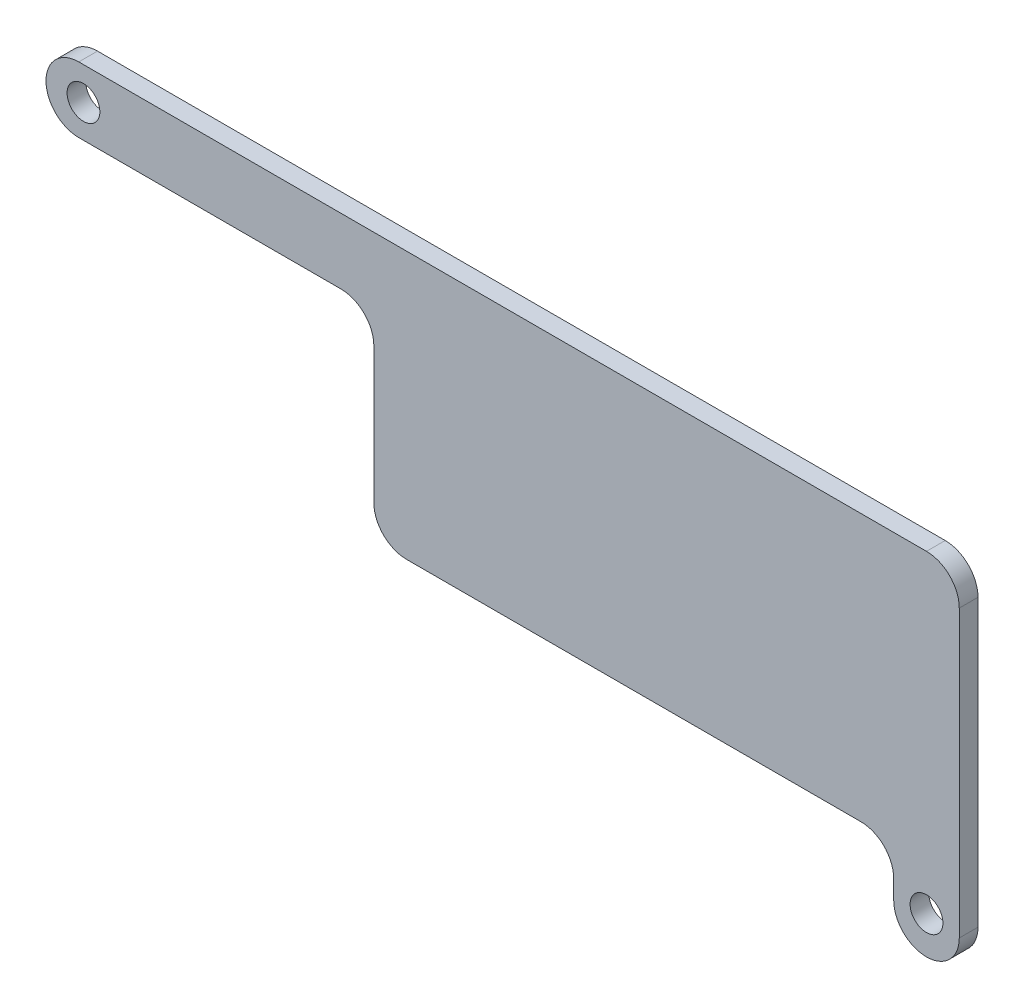
ISO-10303-21;
HEADER;
FILE_DESCRIPTION(('STEP AP214'),'2;1');
FILE_NAME('part.step','',(''),(''),'','','');
FILE_SCHEMA(('AUTOMOTIVE_DESIGN { 1 0 10303 214 1 1 1 1 }'));
ENDSEC;
DATA;
#1=APPLICATION_CONTEXT('core data for automotive mechanical design processes');
#2=APPLICATION_PROTOCOL_DEFINITION('international standard','automotive_design',2000,#1);
#3=PRODUCT_CONTEXT('',#1,'mechanical');
#4=PRODUCT('Part','Part','',(#3));
#5=PRODUCT_RELATED_PRODUCT_CATEGORY('part','',(#4));
#6=PRODUCT_DEFINITION_FORMATION('','',#4);
#7=PRODUCT_DEFINITION_CONTEXT('part definition',#1,'design');
#8=PRODUCT_DEFINITION('design','',#6,#7);
#9=PRODUCT_DEFINITION_SHAPE('','',#8);
#10=(LENGTH_UNIT() NAMED_UNIT(*) SI_UNIT(.MILLI.,.METRE.));
#11=(NAMED_UNIT(*) PLANE_ANGLE_UNIT() SI_UNIT($,.RADIAN.));
#12=(NAMED_UNIT(*) SI_UNIT($,.STERADIAN.) SOLID_ANGLE_UNIT());
#13=UNCERTAINTY_MEASURE_WITH_UNIT(LENGTH_MEASURE(1.E-05),#10,'distance_accuracy_value','');
#14=(GEOMETRIC_REPRESENTATION_CONTEXT(3) GLOBAL_UNCERTAINTY_ASSIGNED_CONTEXT((#13)) GLOBAL_UNIT_ASSIGNED_CONTEXT((#10,
#11,#12)) REPRESENTATION_CONTEXT('',''));
#15=CARTESIAN_POINT('',(0.,0.,0.));
#16=DIRECTION('',(0.,0.,1.));
#17=DIRECTION('',(1.,0.,0.));
#18=AXIS2_PLACEMENT_3D('',#15,#16,#17);
#19=CARTESIAN_POINT('',(0.,9.00000000000001,2.));
#20=DIRECTION('',(0.,-1.,0.));
#21=DIRECTION('',(1.,0.,0.));
#22=AXIS2_PLACEMENT_3D('',#19,#20,#21);
#23=PLANE('',#22);
#24=DIRECTION('',(-1.,0.,0.));
#25=VECTOR('',#24,1.);
#26=CARTESIAN_POINT('',(0.,9.00000000000001,0.));
#27=LINE('',#26,#25);
#28=CARTESIAN_POINT('',(-33.,9.,0.));
#29=VERTEX_POINT('',#28);
#30=CARTESIAN_POINT('',(-61.,9.,0.));
#31=VERTEX_POINT('',#30);
#32=EDGE_CURVE('E223',#29,#31,#27,.T.);
#33=ORIENTED_EDGE('',*,*,#32,.F.);
#34=DIRECTION('',(0.,0.,-1.));
#35=VECTOR('',#34,1.);
#36=CARTESIAN_POINT('',(-33.,9.,2.));
#37=LINE('',#36,#35);
#38=CARTESIAN_POINT('',(-33.,9.,2.));
#39=VERTEX_POINT('',#38);
#40=EDGE_CURVE('E216',#29,#39,#37,.F.);
#41=ORIENTED_EDGE('',*,*,#40,.T.);
#42=DIRECTION('',(-1.,0.,0.));
#43=VECTOR('',#42,1.);
#44=CARTESIAN_POINT('',(0.,9.00000000000001,2.));
#45=LINE('',#44,#43);
#46=CARTESIAN_POINT('',(-61.,9.,2.));
#47=VERTEX_POINT('',#46);
#48=EDGE_CURVE('E268',#39,#47,#45,.T.);
#49=ORIENTED_EDGE('',*,*,#48,.T.);
#50=DIRECTION('',(0.,0.,-1.));
#51=VECTOR('',#50,1.);
#52=CARTESIAN_POINT('',(-61.,9.,2.));
#53=LINE('',#52,#51);
#54=EDGE_CURVE('E214',#47,#31,#53,.T.);
#55=ORIENTED_EDGE('',*,*,#54,.T.);
#56=EDGE_LOOP('',(#33,#41,#49,#55));
#57=FACE_BOUND('',#56,.T.);
#58=ADVANCED_FACE('F39',(#57),#23,.T.);
#59=CARTESIAN_POINT('',(-29.5,0.,2.));
#60=DIRECTION('',(1.,0.,0.));
#61=DIRECTION('',(0.,0.,-1.));
#62=AXIS2_PLACEMENT_3D('',#59,#60,#61);
#63=PLANE('',#62);
#64=DIRECTION('',(0.,-1.,0.));
#65=VECTOR('',#64,1.);
#66=CARTESIAN_POINT('',(-29.5,0.,0.));
#67=LINE('',#66,#65);
#68=CARTESIAN_POINT('',(-29.5,5.5,0.));
#69=VERTEX_POINT('',#68);
#70=CARTESIAN_POINT('',(-29.5,-9.,0.));
#71=VERTEX_POINT('',#70);
#72=EDGE_CURVE('E224',#69,#71,#67,.T.);
#73=ORIENTED_EDGE('',*,*,#72,.T.);
#74=DIRECTION('',(0.,0.,-1.));
#75=VECTOR('',#74,1.);
#76=CARTESIAN_POINT('',(-29.5,-9.,2.));
#77=LINE('',#76,#75);
#78=CARTESIAN_POINT('',(-29.5,-9.,2.));
#79=VERTEX_POINT('',#78);
#80=EDGE_CURVE('E212',#71,#79,#77,.F.);
#81=ORIENTED_EDGE('',*,*,#80,.T.);
#82=DIRECTION('',(0.,-1.,0.));
#83=VECTOR('',#82,1.);
#84=CARTESIAN_POINT('',(-29.5,0.,2.));
#85=LINE('',#84,#83);
#86=CARTESIAN_POINT('',(-29.5,5.5,2.));
#87=VERTEX_POINT('',#86);
#88=EDGE_CURVE('E272',#87,#79,#85,.T.);
#89=ORIENTED_EDGE('',*,*,#88,.F.);
#90=DIRECTION('',(0.,0.,-1.));
#91=VECTOR('',#90,1.);
#92=CARTESIAN_POINT('',(-29.5,5.5,2.));
#93=LINE('',#92,#91);
#94=EDGE_CURVE('E209',#87,#69,#93,.T.);
#95=ORIENTED_EDGE('',*,*,#94,.T.);
#96=EDGE_LOOP('',(#73,#81,#89,#95));
#97=FACE_BOUND('',#96,.T.);
#98=ADVANCED_FACE('F306',(#97),#63,.F.);
#99=CARTESIAN_POINT('',(0.,-12.5,2.));
#100=DIRECTION('',(0.,1.,0.));
#101=DIRECTION('',(-1.,0.,0.));
#102=AXIS2_PLACEMENT_3D('',#99,#100,#101);
#103=PLANE('',#102);
#104=DIRECTION('',(1.,0.,0.));
#105=VECTOR('',#104,1.);
#106=CARTESIAN_POINT('',(0.,-12.5,0.));
#107=LINE('',#106,#105);
#108=CARTESIAN_POINT('',(-26.,-12.5,0.));
#109=VERTEX_POINT('',#108);
#110=CARTESIAN_POINT('',(22.5,-12.5,0.));
#111=VERTEX_POINT('',#110);
#112=EDGE_CURVE('E259',#109,#111,#107,.T.);
#113=ORIENTED_EDGE('',*,*,#112,.T.);
#114=DIRECTION('',(0.,0.,-1.));
#115=VECTOR('',#114,1.);
#116=CARTESIAN_POINT('',(22.5,-12.5,2.));
#117=LINE('',#116,#115);
#118=CARTESIAN_POINT('',(22.5,-12.5,2.));
#119=VERTEX_POINT('',#118);
#120=EDGE_CURVE('E207',#111,#119,#117,.F.);
#121=ORIENTED_EDGE('',*,*,#120,.T.);
#122=DIRECTION('',(1.,0.,0.));
#123=VECTOR('',#122,1.);
#124=CARTESIAN_POINT('',(0.,-12.5,2.));
#125=LINE('',#124,#123);
#126=CARTESIAN_POINT('',(-26.,-12.5,2.));
#127=VERTEX_POINT('',#126);
#128=EDGE_CURVE('E251',#127,#119,#125,.T.);
#129=ORIENTED_EDGE('',*,*,#128,.F.);
#130=DIRECTION('',(0.,0.,-1.));
#131=VECTOR('',#130,1.);
#132=CARTESIAN_POINT('',(-26.,-12.5,2.));
#133=LINE('',#132,#131);
#134=EDGE_CURVE('E204',#127,#109,#133,.T.);
#135=ORIENTED_EDGE('',*,*,#134,.T.);
#136=EDGE_LOOP('',(#113,#121,#129,#135));
#137=FACE_BOUND('',#136,.T.);
#138=ADVANCED_FACE('F310',(#137),#103,.F.);
#139=CARTESIAN_POINT('',(26.,0.,2.));
#140=DIRECTION('',(-1.,0.,0.));
#141=DIRECTION('',(0.,0.,1.));
#142=AXIS2_PLACEMENT_3D('',#139,#140,#141);
#143=PLANE('',#142);
#144=DIRECTION('',(0.,1.,0.));
#145=VECTOR('',#144,1.);
#146=CARTESIAN_POINT('',(26.,0.,2.));
#147=LINE('',#146,#145);
#148=CARTESIAN_POINT('',(26.,-18.,2.));
#149=VERTEX_POINT('',#148);
#150=CARTESIAN_POINT('',(26.,-16.,2.));
#151=VERTEX_POINT('',#150);
#152=EDGE_CURVE('E247',#149,#151,#147,.T.);
#153=ORIENTED_EDGE('',*,*,#152,.T.);
#154=DIRECTION('',(0.,0.,-1.));
#155=VECTOR('',#154,1.);
#156=CARTESIAN_POINT('',(26.,-16.,2.));
#157=LINE('',#156,#155);
#158=CARTESIAN_POINT('',(26.,-16.,0.));
#159=VERTEX_POINT('',#158);
#160=EDGE_CURVE('E201',#151,#159,#157,.T.);
#161=ORIENTED_EDGE('',*,*,#160,.T.);
#162=DIRECTION('',(0.,1.,0.));
#163=VECTOR('',#162,1.);
#164=CARTESIAN_POINT('',(26.,0.,0.));
#165=LINE('',#164,#163);
#166=CARTESIAN_POINT('',(26.,-18.,0.));
#167=VERTEX_POINT('',#166);
#168=EDGE_CURVE('E262',#167,#159,#165,.T.);
#169=ORIENTED_EDGE('',*,*,#168,.F.);
#170=DIRECTION('',(0.,0.,-1.));
#171=VECTOR('',#170,1.);
#172=CARTESIAN_POINT('',(26.,-18.,2.));
#173=LINE('',#172,#171);
#174=EDGE_CURVE('E198',#167,#149,#173,.F.);
#175=ORIENTED_EDGE('',*,*,#174,.T.);
#176=EDGE_LOOP('',(#153,#161,#169,#175));
#177=FACE_BOUND('',#176,.T.);
#178=ADVANCED_FACE('F291',(#177),#143,.T.);
#179=CARTESIAN_POINT('',(33.,0.,2.));
#180=DIRECTION('',(1.,0.,0.));
#181=DIRECTION('',(0.,0.,-1.));
#182=AXIS2_PLACEMENT_3D('',#179,#180,#181);
#183=PLANE('',#182);
#184=DIRECTION('',(0.,-1.,0.));
#185=VECTOR('',#184,1.);
#186=CARTESIAN_POINT('',(33.,0.,0.));
#187=LINE('',#186,#185);
#188=CARTESIAN_POINT('',(33.,12.5,0.));
#189=VERTEX_POINT('',#188);
#190=CARTESIAN_POINT('',(33.,-18.,0.));
#191=VERTEX_POINT('',#190);
#192=EDGE_CURVE('E163',#189,#191,#187,.T.);
#193=ORIENTED_EDGE('',*,*,#192,.F.);
#194=DIRECTION('',(0.,0.,-1.));
#195=VECTOR('',#194,1.);
#196=CARTESIAN_POINT('',(33.,12.5,2.));
#197=LINE('',#196,#195);
#198=CARTESIAN_POINT('',(33.,12.5,2.));
#199=VERTEX_POINT('',#198);
#200=EDGE_CURVE('E186',#189,#199,#197,.F.);
#201=ORIENTED_EDGE('',*,*,#200,.T.);
#202=DIRECTION('',(0.,-1.,0.));
#203=VECTOR('',#202,1.);
#204=CARTESIAN_POINT('',(33.,0.,2.));
#205=LINE('',#204,#203);
#206=CARTESIAN_POINT('',(33.,-18.,2.));
#207=VERTEX_POINT('',#206);
#208=EDGE_CURVE('E239',#199,#207,#205,.T.);
#209=ORIENTED_EDGE('',*,*,#208,.T.);
#210=DIRECTION('',(0.,0.,-1.));
#211=VECTOR('',#210,1.);
#212=CARTESIAN_POINT('',(33.,-18.,2.));
#213=LINE('',#212,#211);
#214=EDGE_CURVE('E184',#207,#191,#213,.T.);
#215=ORIENTED_EDGE('',*,*,#214,.T.);
#216=EDGE_LOOP('',(#193,#201,#209,#215));
#217=FACE_BOUND('',#216,.T.);
#218=ADVANCED_FACE('F243',(#217),#183,.T.);
#219=CARTESIAN_POINT('',(0.,16.,2.));
#220=DIRECTION('',(0.,1.,0.));
#221=DIRECTION('',(0.,0.,1.));
#222=AXIS2_PLACEMENT_3D('',#219,#220,#221);
#223=PLANE('',#222);
#224=DIRECTION('',(1.,0.,0.));
#225=VECTOR('',#224,1.);
#226=CARTESIAN_POINT('',(0.,16.,2.));
#227=LINE('',#226,#225);
#228=CARTESIAN_POINT('',(-61.,16.,2.));
#229=VERTEX_POINT('',#228);
#230=CARTESIAN_POINT('',(29.5,16.,2.));
#231=VERTEX_POINT('',#230);
#232=EDGE_CURVE('E246',#229,#231,#227,.T.);
#233=ORIENTED_EDGE('',*,*,#232,.T.);
#234=DIRECTION('',(0.,0.,-1.));
#235=VECTOR('',#234,1.);
#236=CARTESIAN_POINT('',(29.5,16.,2.));
#237=LINE('',#236,#235);
#238=CARTESIAN_POINT('',(29.5,16.,0.));
#239=VERTEX_POINT('',#238);
#240=EDGE_CURVE('E161',#231,#239,#237,.T.);
#241=ORIENTED_EDGE('',*,*,#240,.T.);
#242=DIRECTION('',(1.,0.,0.));
#243=VECTOR('',#242,1.);
#244=CARTESIAN_POINT('',(0.,16.,0.));
#245=LINE('',#244,#243);
#246=CARTESIAN_POINT('',(-61.,16.,0.));
#247=VERTEX_POINT('',#246);
#248=EDGE_CURVE('E144',#247,#239,#245,.T.);
#249=ORIENTED_EDGE('',*,*,#248,.F.);
#250=DIRECTION('',(0.,0.,-1.));
#251=VECTOR('',#250,1.);
#252=CARTESIAN_POINT('',(-61.,16.,2.));
#253=LINE('',#252,#251);
#254=EDGE_CURVE('E159',#247,#229,#253,.F.);
#255=ORIENTED_EDGE('',*,*,#254,.T.);
#256=EDGE_LOOP('',(#233,#241,#249,#255));
#257=FACE_BOUND('',#256,.T.);
#258=ADVANCED_FACE('F158',(#257),#223,.T.);
#259=CARTESIAN_POINT('',(29.5,-17.5,2.));
#260=DIRECTION('',(0.,0.,-1.));
#261=DIRECTION('',(-1.,0.,0.));
#262=AXIS2_PLACEMENT_3D('',#259,#260,#261);
#263=CYLINDRICAL_SURFACE('',#262,1.75);
#264=CARTESIAN_POINT('',(29.5,-17.5,2.));
#265=DIRECTION('',(0.,0.,1.));
#266=DIRECTION('',(1.,0.,0.));
#267=AXIS2_PLACEMENT_3D('',#264,#265,#266);
#268=CIRCLE('',#267,1.75);
#269=CARTESIAN_POINT('',(31.25,-17.5,2.));
#270=VERTEX_POINT('',#269);
#271=EDGE_CURVE('E171',#270,#270,#268,.T.);
#272=ORIENTED_EDGE('',*,*,#271,.T.);
#273=EDGE_LOOP('',(#272));
#274=FACE_BOUND('',#273,.T.);
#275=CARTESIAN_POINT('',(29.5,-17.5,0.));
#276=DIRECTION('',(0.,0.,1.));
#277=DIRECTION('',(1.,0.,0.));
#278=AXIS2_PLACEMENT_3D('',#275,#276,#277);
#279=CIRCLE('',#278,1.75);
#280=CARTESIAN_POINT('',(31.25,-17.5,0.));
#281=VERTEX_POINT('',#280);
#282=EDGE_CURVE('E162',#281,#281,#279,.T.);
#283=ORIENTED_EDGE('',*,*,#282,.F.);
#284=EDGE_LOOP('',(#283));
#285=FACE_BOUND('',#284,.T.);
#286=ADVANCED_FACE('F323',(#274,#285),#263,.F.);
#287=CARTESIAN_POINT('',(-60.5,12.5,2.));
#288=DIRECTION('',(0.,0.,-1.));
#289=DIRECTION('',(-1.,0.,0.));
#290=AXIS2_PLACEMENT_3D('',#287,#288,#289);
#291=CYLINDRICAL_SURFACE('',#290,1.75);
#292=CARTESIAN_POINT('',(-60.5,12.5,2.));
#293=DIRECTION('',(0.,0.,1.));
#294=DIRECTION('',(1.,0.,0.));
#295=AXIS2_PLACEMENT_3D('',#292,#293,#294);
#296=CIRCLE('',#295,1.75);
#297=CARTESIAN_POINT('',(-58.75,12.5,2.));
#298=VERTEX_POINT('',#297);
#299=EDGE_CURVE('E166',#298,#298,#296,.T.);
#300=ORIENTED_EDGE('',*,*,#299,.T.);
#301=EDGE_LOOP('',(#300));
#302=FACE_BOUND('',#301,.T.);
#303=CARTESIAN_POINT('',(-60.5,12.5,0.));
#304=DIRECTION('',(0.,0.,1.));
#305=DIRECTION('',(1.,0.,0.));
#306=AXIS2_PLACEMENT_3D('',#303,#304,#305);
#307=CIRCLE('',#306,1.75);
#308=CARTESIAN_POINT('',(-58.75,12.5,0.));
#309=VERTEX_POINT('',#308);
#310=EDGE_CURVE('E174',#309,#309,#307,.T.);
#311=ORIENTED_EDGE('',*,*,#310,.F.);
#312=EDGE_LOOP('',(#311));
#313=FACE_BOUND('',#312,.T.);
#314=ADVANCED_FACE('F326',(#302,#313),#291,.F.);
#315=CARTESIAN_POINT('',(0.,0.,2.));
#316=DIRECTION('',(0.,0.,1.));
#317=DIRECTION('',(1.,0.,0.));
#318=AXIS2_PLACEMENT_3D('',#315,#316,#317);
#319=PLANE('',#318);
#320=ORIENTED_EDGE('',*,*,#208,.F.);
#321=CARTESIAN_POINT('',(29.5,12.5,2.));
#322=DIRECTION('',(0.,0.,1.));
#323=DIRECTION('',(1.,0.,0.));
#324=AXIS2_PLACEMENT_3D('',#321,#322,#323);
#325=CIRCLE('',#324,3.5);
#326=EDGE_CURVE('E196',#199,#231,#325,.T.);
#327=ORIENTED_EDGE('',*,*,#326,.T.);
#328=ORIENTED_EDGE('',*,*,#232,.F.);
#329=CARTESIAN_POINT('',(-61.,12.5,2.));
#330=DIRECTION('',(0.,0.,1.));
#331=DIRECTION('',(1.,0.,0.));
#332=AXIS2_PLACEMENT_3D('',#329,#330,#331);
#333=CIRCLE('',#332,3.5);
#334=CARTESIAN_POINT('',(-64.5,12.5,2.));
#335=VERTEX_POINT('',#334);
#336=EDGE_CURVE('E56',#229,#335,#333,.T.);
#337=ORIENTED_EDGE('',*,*,#336,.T.);
#338=CARTESIAN_POINT('',(-61.,12.5,2.));
#339=DIRECTION('',(0.,0.,1.));
#340=DIRECTION('',(1.,0.,0.));
#341=AXIS2_PLACEMENT_3D('',#338,#339,#340);
#342=CIRCLE('',#341,3.5);
#343=EDGE_CURVE('E191',#335,#47,#342,.T.);
#344=ORIENTED_EDGE('',*,*,#343,.T.);
#345=ORIENTED_EDGE('',*,*,#48,.F.);
#346=CARTESIAN_POINT('',(-33.,5.5,2.));
#347=DIRECTION('',(0.,0.,1.));
#348=DIRECTION('',(1.,0.,0.));
#349=AXIS2_PLACEMENT_3D('',#346,#347,#348);
#350=CIRCLE('',#349,3.5);
#351=EDGE_CURVE('E11',#39,#87,#350,.F.);
#352=ORIENTED_EDGE('',*,*,#351,.T.);
#353=ORIENTED_EDGE('',*,*,#88,.T.);
#354=CARTESIAN_POINT('',(-26.,-9.,2.));
#355=DIRECTION('',(0.,0.,1.));
#356=DIRECTION('',(1.,0.,0.));
#357=AXIS2_PLACEMENT_3D('',#354,#355,#356);
#358=CIRCLE('',#357,3.5);
#359=EDGE_CURVE('E194',#79,#127,#358,.T.);
#360=ORIENTED_EDGE('',*,*,#359,.T.);
#361=ORIENTED_EDGE('',*,*,#128,.T.);
#362=CARTESIAN_POINT('',(22.5,-16.,2.));
#363=DIRECTION('',(0.,0.,1.));
#364=DIRECTION('',(1.,0.,0.));
#365=AXIS2_PLACEMENT_3D('',#362,#363,#364);
#366=CIRCLE('',#365,3.5);
#367=EDGE_CURVE('E220',#119,#151,#366,.F.);
#368=ORIENTED_EDGE('',*,*,#367,.T.);
#369=ORIENTED_EDGE('',*,*,#152,.F.);
#370=CARTESIAN_POINT('',(29.5,-18.,2.));
#371=DIRECTION('',(0.,0.,1.));
#372=DIRECTION('',(1.,0.,0.));
#373=AXIS2_PLACEMENT_3D('',#370,#371,#372);
#374=CIRCLE('',#373,3.5);
#375=CARTESIAN_POINT('',(29.5,-21.5,2.));
#376=VERTEX_POINT('',#375);
#377=EDGE_CURVE('E63',#149,#376,#374,.T.);
#378=ORIENTED_EDGE('',*,*,#377,.T.);
#379=CARTESIAN_POINT('',(29.5,-18.,2.));
#380=DIRECTION('',(0.,0.,1.));
#381=DIRECTION('',(1.,0.,0.));
#382=AXIS2_PLACEMENT_3D('',#379,#380,#381);
#383=CIRCLE('',#382,3.5);
#384=EDGE_CURVE('E188',#376,#207,#383,.T.);
#385=ORIENTED_EDGE('',*,*,#384,.T.);
#386=EDGE_LOOP('',(#320,#327,#328,#337,#344,#345,#352,#353,#360,#361,#368,#369,#378,#385));
#387=FACE_BOUND('',#386,.T.);
#388=ORIENTED_EDGE('',*,*,#271,.F.);
#389=EDGE_LOOP('',(#388));
#390=FACE_BOUND('',#389,.T.);
#391=ORIENTED_EDGE('',*,*,#299,.F.);
#392=EDGE_LOOP('',(#391));
#393=FACE_BOUND('',#392,.T.);
#394=ADVANCED_FACE('F237',(#387,#390,#393),#319,.T.);
#395=CARTESIAN_POINT('',(0.,0.,0.));
#396=DIRECTION('',(0.,0.,1.));
#397=DIRECTION('',(1.,0.,0.));
#398=AXIS2_PLACEMENT_3D('',#395,#396,#397);
#399=PLANE('',#398);
#400=ORIENTED_EDGE('',*,*,#248,.T.);
#401=CARTESIAN_POINT('',(29.5,12.5,0.));
#402=DIRECTION('',(0.,0.,1.));
#403=DIRECTION('',(1.,0.,0.));
#404=AXIS2_PLACEMENT_3D('',#401,#402,#403);
#405=CIRCLE('',#404,3.5);
#406=EDGE_CURVE('E182',#239,#189,#405,.F.);
#407=ORIENTED_EDGE('',*,*,#406,.T.);
#408=ORIENTED_EDGE('',*,*,#192,.T.);
#409=CARTESIAN_POINT('',(29.5,-18.,0.));
#410=DIRECTION('',(0.,0.,1.));
#411=DIRECTION('',(1.,0.,0.));
#412=AXIS2_PLACEMENT_3D('',#409,#410,#411);
#413=CIRCLE('',#412,3.5);
#414=CARTESIAN_POINT('',(29.5,-21.5,0.));
#415=VERTEX_POINT('',#414);
#416=EDGE_CURVE('E168',#191,#415,#413,.F.);
#417=ORIENTED_EDGE('',*,*,#416,.T.);
#418=CARTESIAN_POINT('',(29.5,-18.,0.));
#419=DIRECTION('',(0.,0.,1.));
#420=DIRECTION('',(1.,0.,0.));
#421=AXIS2_PLACEMENT_3D('',#418,#419,#420);
#422=CIRCLE('',#421,3.5);
#423=EDGE_CURVE('E178',#415,#167,#422,.F.);
#424=ORIENTED_EDGE('',*,*,#423,.T.);
#425=ORIENTED_EDGE('',*,*,#168,.T.);
#426=CARTESIAN_POINT('',(22.5,-16.,0.));
#427=DIRECTION('',(0.,0.,1.));
#428=DIRECTION('',(1.,0.,0.));
#429=AXIS2_PLACEMENT_3D('',#426,#427,#428);
#430=CIRCLE('',#429,3.5);
#431=EDGE_CURVE('E218',#159,#111,#430,.T.);
#432=ORIENTED_EDGE('',*,*,#431,.T.);
#433=ORIENTED_EDGE('',*,*,#112,.F.);
#434=CARTESIAN_POINT('',(-26.,-9.,0.));
#435=DIRECTION('',(0.,0.,1.));
#436=DIRECTION('',(1.,0.,0.));
#437=AXIS2_PLACEMENT_3D('',#434,#435,#436);
#438=CIRCLE('',#437,3.5);
#439=EDGE_CURVE('E152',#109,#71,#438,.F.);
#440=ORIENTED_EDGE('',*,*,#439,.T.);
#441=ORIENTED_EDGE('',*,*,#72,.F.);
#442=CARTESIAN_POINT('',(-33.,5.5,0.));
#443=DIRECTION('',(0.,0.,1.));
#444=DIRECTION('',(1.,0.,0.));
#445=AXIS2_PLACEMENT_3D('',#442,#443,#444);
#446=CIRCLE('',#445,3.5);
#447=EDGE_CURVE('E48',#69,#29,#446,.T.);
#448=ORIENTED_EDGE('',*,*,#447,.T.);
#449=ORIENTED_EDGE('',*,*,#32,.T.);
#450=CARTESIAN_POINT('',(-61.,12.5,0.));
#451=DIRECTION('',(0.,0.,1.));
#452=DIRECTION('',(1.,0.,0.));
#453=AXIS2_PLACEMENT_3D('',#450,#451,#452);
#454=CIRCLE('',#453,3.5);
#455=CARTESIAN_POINT('',(-64.5,12.5,0.));
#456=VERTEX_POINT('',#455);
#457=EDGE_CURVE('E147',#31,#456,#454,.F.);
#458=ORIENTED_EDGE('',*,*,#457,.T.);
#459=CARTESIAN_POINT('',(-61.,12.5,0.));
#460=DIRECTION('',(0.,0.,1.));
#461=DIRECTION('',(1.,0.,0.));
#462=AXIS2_PLACEMENT_3D('',#459,#460,#461);
#463=CIRCLE('',#462,3.5);
#464=EDGE_CURVE('E140',#456,#247,#463,.F.);
#465=ORIENTED_EDGE('',*,*,#464,.T.);
#466=EDGE_LOOP('',(#400,#407,#408,#417,#424,#425,#432,#433,#440,#441,#448,#449,#458,#465));
#467=FACE_BOUND('',#466,.T.);
#468=ORIENTED_EDGE('',*,*,#282,.T.);
#469=EDGE_LOOP('',(#468));
#470=FACE_BOUND('',#469,.T.);
#471=ORIENTED_EDGE('',*,*,#310,.T.);
#472=EDGE_LOOP('',(#471));
#473=FACE_BOUND('',#472,.T.);
#474=ADVANCED_FACE('F142',(#467,#470,#473),#399,.F.);
#475=CARTESIAN_POINT('',(29.5,12.5,2.));
#476=DIRECTION('',(0.,0.,-1.));
#477=DIRECTION('',(-1.,0.,0.));
#478=AXIS2_PLACEMENT_3D('',#475,#476,#477);
#479=CYLINDRICAL_SURFACE('',#478,3.5);
#480=ORIENTED_EDGE('',*,*,#326,.F.);
#481=ORIENTED_EDGE('',*,*,#200,.F.);
#482=ORIENTED_EDGE('',*,*,#406,.F.);
#483=ORIENTED_EDGE('',*,*,#240,.F.);
#484=EDGE_LOOP('',(#480,#481,#482,#483));
#485=FACE_BOUND('',#484,.T.);
#486=ADVANCED_FACE('F294',(#485),#479,.T.);
#487=CARTESIAN_POINT('',(22.5,-16.,2.));
#488=DIRECTION('',(0.,0.,-1.));
#489=DIRECTION('',(-1.,0.,0.));
#490=AXIS2_PLACEMENT_3D('',#487,#488,#489);
#491=CYLINDRICAL_SURFACE('',#490,3.5);
#492=ORIENTED_EDGE('',*,*,#367,.F.);
#493=ORIENTED_EDGE('',*,*,#120,.F.);
#494=ORIENTED_EDGE('',*,*,#431,.F.);
#495=ORIENTED_EDGE('',*,*,#160,.F.);
#496=EDGE_LOOP('',(#492,#493,#494,#495));
#497=FACE_BOUND('',#496,.T.);
#498=ADVANCED_FACE('F288',(#497),#491,.F.);
#499=CARTESIAN_POINT('',(-26.,-9.,2.));
#500=DIRECTION('',(0.,0.,-1.));
#501=DIRECTION('',(-1.,0.,0.));
#502=AXIS2_PLACEMENT_3D('',#499,#500,#501);
#503=CYLINDRICAL_SURFACE('',#502,3.5);
#504=ORIENTED_EDGE('',*,*,#359,.F.);
#505=ORIENTED_EDGE('',*,*,#80,.F.);
#506=ORIENTED_EDGE('',*,*,#439,.F.);
#507=ORIENTED_EDGE('',*,*,#134,.F.);
#508=EDGE_LOOP('',(#504,#505,#506,#507));
#509=FACE_BOUND('',#508,.T.);
#510=ADVANCED_FACE('F301',(#509),#503,.T.);
#511=CARTESIAN_POINT('',(-33.,5.5,2.));
#512=DIRECTION('',(0.,0.,-1.));
#513=DIRECTION('',(-1.,0.,0.));
#514=AXIS2_PLACEMENT_3D('',#511,#512,#513);
#515=CYLINDRICAL_SURFACE('',#514,3.5);
#516=ORIENTED_EDGE('',*,*,#351,.F.);
#517=ORIENTED_EDGE('',*,*,#40,.F.);
#518=ORIENTED_EDGE('',*,*,#447,.F.);
#519=ORIENTED_EDGE('',*,*,#94,.F.);
#520=EDGE_LOOP('',(#516,#517,#518,#519));
#521=FACE_BOUND('',#520,.T.);
#522=ADVANCED_FACE('F363',(#521),#515,.F.);
#523=CARTESIAN_POINT('',(-61.,12.5,2.));
#524=DIRECTION('',(0.,0.,-1.));
#525=DIRECTION('',(-1.,0.,0.));
#526=AXIS2_PLACEMENT_3D('',#523,#524,#525);
#527=CYLINDRICAL_SURFACE('',#526,3.5);
#528=ORIENTED_EDGE('',*,*,#54,.F.);
#529=ORIENTED_EDGE('',*,*,#343,.F.);
#530=DIRECTION('',(0.,0.,-1.));
#531=VECTOR('',#530,1.);
#532=CARTESIAN_POINT('',(-64.5,12.5,2.));
#533=LINE('',#532,#531);
#534=EDGE_CURVE('E222',#456,#335,#533,.F.);
#535=ORIENTED_EDGE('',*,*,#534,.F.);
#536=ORIENTED_EDGE('',*,*,#457,.F.);
#537=EDGE_LOOP('',(#528,#529,#535,#536));
#538=FACE_BOUND('',#537,.T.);
#539=ADVANCED_FACE('F374',(#538),#527,.T.);
#540=CARTESIAN_POINT('',(-61.,12.5,2.));
#541=DIRECTION('',(0.,0.,-1.));
#542=DIRECTION('',(-1.,0.,0.));
#543=AXIS2_PLACEMENT_3D('',#540,#541,#542);
#544=CYLINDRICAL_SURFACE('',#543,3.5);
#545=ORIENTED_EDGE('',*,*,#336,.F.);
#546=ORIENTED_EDGE('',*,*,#254,.F.);
#547=ORIENTED_EDGE('',*,*,#464,.F.);
#548=ORIENTED_EDGE('',*,*,#534,.T.);
#549=EDGE_LOOP('',(#545,#546,#547,#548));
#550=FACE_BOUND('',#549,.T.);
#551=ADVANCED_FACE('F165',(#550),#544,.T.);
#552=CARTESIAN_POINT('',(29.5,-18.,2.));
#553=DIRECTION('',(0.,0.,-1.));
#554=DIRECTION('',(-1.,0.,0.));
#555=AXIS2_PLACEMENT_3D('',#552,#553,#554);
#556=CYLINDRICAL_SURFACE('',#555,3.5);
#557=ORIENTED_EDGE('',*,*,#214,.F.);
#558=ORIENTED_EDGE('',*,*,#384,.F.);
#559=DIRECTION('',(0.,0.,-1.));
#560=VECTOR('',#559,1.);
#561=CARTESIAN_POINT('',(29.5,-21.5,2.));
#562=LINE('',#561,#560);
#563=EDGE_CURVE('E43',#415,#376,#562,.F.);
#564=ORIENTED_EDGE('',*,*,#563,.F.);
#565=ORIENTED_EDGE('',*,*,#416,.F.);
#566=EDGE_LOOP('',(#557,#558,#564,#565));
#567=FACE_BOUND('',#566,.T.);
#568=ADVANCED_FACE('F41',(#567),#556,.T.);
#569=CARTESIAN_POINT('',(29.5,-18.,2.));
#570=DIRECTION('',(0.,0.,-1.));
#571=DIRECTION('',(-1.,0.,0.));
#572=AXIS2_PLACEMENT_3D('',#569,#570,#571);
#573=CYLINDRICAL_SURFACE('',#572,3.5);
#574=ORIENTED_EDGE('',*,*,#377,.F.);
#575=ORIENTED_EDGE('',*,*,#174,.F.);
#576=ORIENTED_EDGE('',*,*,#423,.F.);
#577=ORIENTED_EDGE('',*,*,#563,.T.);
#578=EDGE_LOOP('',(#574,#575,#576,#577));
#579=FACE_BOUND('',#578,.T.);
#580=ADVANCED_FACE('F230',(#579),#573,.T.);
#581=CLOSED_SHELL('',(#58,#98,#138,#178,#218,#258,#286,#314,#394,#474,#486,#498,#510,#522,#539,
#551,#568,#580));
#582=MANIFOLD_SOLID_BREP('B2',#581);
#583=ADVANCED_BREP_SHAPE_REPRESENTATION('',(#18,#582),#14);
#584=SHAPE_DEFINITION_REPRESENTATION(#9,#583);
ENDSEC;
END-ISO-10303-21;
